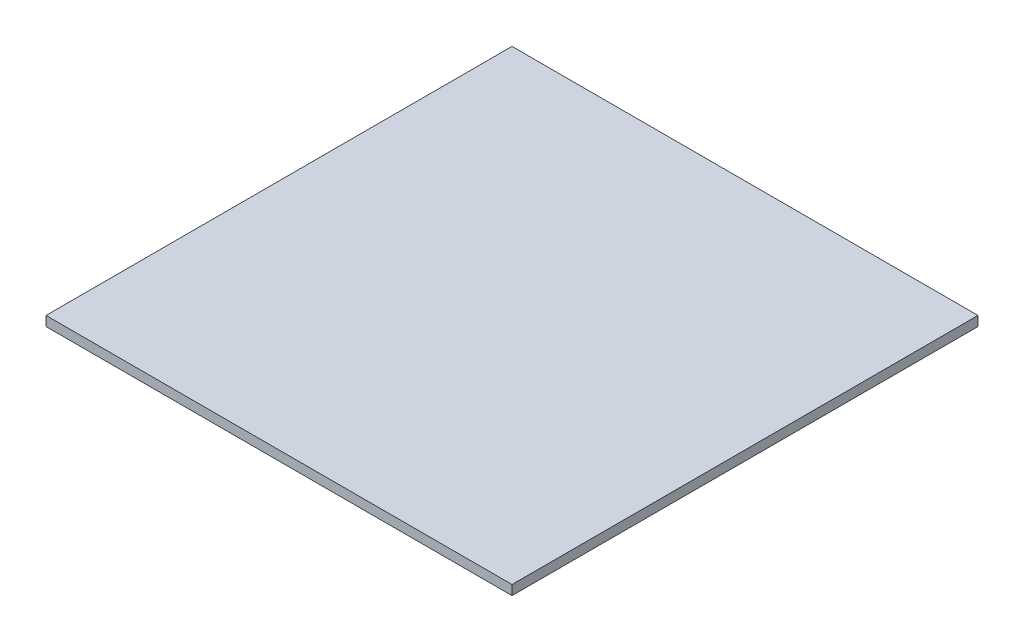
ISO-10303-21;
HEADER;
FILE_DESCRIPTION(('STEP AP214'),'2;1');
FILE_NAME('part.step','',(''),(''),'','','');
FILE_SCHEMA(('AUTOMOTIVE_DESIGN { 1 0 10303 214 1 1 1 1 }'));
ENDSEC;
DATA;
#1=APPLICATION_CONTEXT('core data for automotive mechanical design processes');
#2=APPLICATION_PROTOCOL_DEFINITION('international standard','automotive_design',2000,#1);
#3=PRODUCT_CONTEXT('',#1,'mechanical');
#4=PRODUCT('Part','Part','',(#3));
#5=PRODUCT_RELATED_PRODUCT_CATEGORY('part','',(#4));
#6=PRODUCT_DEFINITION_FORMATION('','',#4);
#7=PRODUCT_DEFINITION_CONTEXT('part definition',#1,'design');
#8=PRODUCT_DEFINITION('design','',#6,#7);
#9=PRODUCT_DEFINITION_SHAPE('','',#8);
#10=(LENGTH_UNIT() NAMED_UNIT(*) SI_UNIT(.MILLI.,.METRE.));
#11=(NAMED_UNIT(*) PLANE_ANGLE_UNIT() SI_UNIT($,.RADIAN.));
#12=(NAMED_UNIT(*) SI_UNIT($,.STERADIAN.) SOLID_ANGLE_UNIT());
#13=UNCERTAINTY_MEASURE_WITH_UNIT(LENGTH_MEASURE(1.E-05),#10,'distance_accuracy_value','');
#14=(GEOMETRIC_REPRESENTATION_CONTEXT(3) GLOBAL_UNCERTAINTY_ASSIGNED_CONTEXT((#13)) GLOBAL_UNIT_ASSIGNED_CONTEXT((#10,
#11,#12)) REPRESENTATION_CONTEXT('',''));
#15=CARTESIAN_POINT('',(0.,0.,0.));
#16=DIRECTION('',(0.,0.,1.));
#17=DIRECTION('',(1.,0.,0.));
#18=AXIS2_PLACEMENT_3D('',#15,#16,#17);
#19=CARTESIAN_POINT('',(0.,36.,0.));
#20=DIRECTION('',(0.,-1.,0.));
#21=DIRECTION('',(0.,0.,-1.));
#22=AXIS2_PLACEMENT_3D('',#19,#20,#21);
#23=CYLINDRICAL_SURFACE('',#22,59.9999999999996);
#24=CARTESIAN_POINT('',(0.,36.,0.));
#25=DIRECTION('',(0.,1.,0.));
#26=DIRECTION('',(0.,0.,1.));
#27=AXIS2_PLACEMENT_3D('',#24,#25,#26);
#28=CIRCLE('',#27,59.9999999999996);
#29=CARTESIAN_POINT('',(0.,36.,59.9999999999996));
#30=VERTEX_POINT('',#29);
#31=EDGE_CURVE('E11',#30,#30,#28,.T.);
#32=ORIENTED_EDGE('',*,*,#31,.F.);
#33=EDGE_LOOP('',(#32));
#34=FACE_BOUND('',#33,.T.);
#35=CARTESIAN_POINT('',(0.,0.,0.));
#36=DIRECTION('',(0.,1.,0.));
#37=DIRECTION('',(0.,0.,1.));
#38=AXIS2_PLACEMENT_3D('',#35,#36,#37);
#39=CIRCLE('',#38,59.9999999999996);
#40=CARTESIAN_POINT('',(0.,0.,59.9999999999996));
#41=VERTEX_POINT('',#40);
#42=EDGE_CURVE('E39',#41,#41,#39,.T.);
#43=ORIENTED_EDGE('',*,*,#42,.T.);
#44=EDGE_LOOP('',(#43));
#45=FACE_BOUND('',#44,.T.);
#46=ADVANCED_FACE('F36',(#34,#45),#23,.T.);
#47=CARTESIAN_POINT('',(0.,0.,0.));
#48=DIRECTION('',(0.,1.,0.));
#49=DIRECTION('',(0.,0.,1.));
#50=AXIS2_PLACEMENT_3D('',#47,#48,#49);
#51=PLANE('',#50);
#52=ORIENTED_EDGE('',*,*,#42,.F.);
#53=EDGE_LOOP('',(#52));
#54=FACE_BOUND('',#53,.T.);
#55=ADVANCED_FACE('F115',(#54),#51,.F.);
#56=CARTESIAN_POINT('',(-145.,42.,-145.));
#57=DIRECTION('',(1.,0.,0.));
#58=DIRECTION('',(0.,0.,-1.));
#59=AXIS2_PLACEMENT_3D('',#56,#57,#58);
#60=PLANE('',#59);
#61=DIRECTION('',(0.,0.,1.));
#62=VECTOR('',#61,1.);
#63=CARTESIAN_POINT('',(-145.,36.,-145.));
#64=LINE('',#63,#62);
#65=CARTESIAN_POINT('',(-145.,36.,-145.));
#66=VERTEX_POINT('',#65);
#67=CARTESIAN_POINT('',(-145.,36.,145.));
#68=VERTEX_POINT('',#67);
#69=EDGE_CURVE('E103',#66,#68,#64,.T.);
#70=ORIENTED_EDGE('',*,*,#69,.T.);
#71=DIRECTION('',(0.,-1.,0.));
#72=VECTOR('',#71,1.);
#73=CARTESIAN_POINT('',(-145.,42.,145.));
#74=LINE('',#73,#72);
#75=CARTESIAN_POINT('',(-145.,42.,145.));
#76=VERTEX_POINT('',#75);
#77=EDGE_CURVE('E94',#76,#68,#74,.T.);
#78=ORIENTED_EDGE('',*,*,#77,.F.);
#79=DIRECTION('',(0.,0.,1.));
#80=VECTOR('',#79,1.);
#81=CARTESIAN_POINT('',(-145.,42.,-145.));
#82=LINE('',#81,#80);
#83=CARTESIAN_POINT('',(-145.,42.,-145.));
#84=VERTEX_POINT('',#83);
#85=EDGE_CURVE('E88',#84,#76,#82,.T.);
#86=ORIENTED_EDGE('',*,*,#85,.F.);
#87=DIRECTION('',(0.,-1.,0.));
#88=VECTOR('',#87,1.);
#89=CARTESIAN_POINT('',(-145.,42.,-145.));
#90=LINE('',#89,#88);
#91=EDGE_CURVE('E99',#84,#66,#90,.T.);
#92=ORIENTED_EDGE('',*,*,#91,.T.);
#93=EDGE_LOOP('',(#70,#78,#86,#92));
#94=FACE_BOUND('',#93,.T.);
#95=ADVANCED_FACE('F117',(#94),#60,.F.);
#96=CARTESIAN_POINT('',(-145.,42.,145.));
#97=DIRECTION('',(0.,0.,-1.));
#98=DIRECTION('',(-1.,0.,0.));
#99=AXIS2_PLACEMENT_3D('',#96,#97,#98);
#100=PLANE('',#99);
#101=DIRECTION('',(1.,0.,0.));
#102=VECTOR('',#101,1.);
#103=CARTESIAN_POINT('',(-145.,36.,145.));
#104=LINE('',#103,#102);
#105=CARTESIAN_POINT('',(145.,36.,145.));
#106=VERTEX_POINT('',#105);
#107=EDGE_CURVE('E93',#68,#106,#104,.T.);
#108=ORIENTED_EDGE('',*,*,#107,.T.);
#109=DIRECTION('',(0.,-1.,0.));
#110=VECTOR('',#109,1.);
#111=CARTESIAN_POINT('',(145.,42.,145.));
#112=LINE('',#111,#110);
#113=CARTESIAN_POINT('',(145.,42.,145.));
#114=VERTEX_POINT('',#113);
#115=EDGE_CURVE('E91',#114,#106,#112,.T.);
#116=ORIENTED_EDGE('',*,*,#115,.F.);
#117=DIRECTION('',(1.,0.,0.));
#118=VECTOR('',#117,1.);
#119=CARTESIAN_POINT('',(-145.,42.,145.));
#120=LINE('',#119,#118);
#121=EDGE_CURVE('E83',#76,#114,#120,.T.);
#122=ORIENTED_EDGE('',*,*,#121,.F.);
#123=ORIENTED_EDGE('',*,*,#77,.T.);
#124=EDGE_LOOP('',(#108,#116,#122,#123));
#125=FACE_BOUND('',#124,.T.);
#126=ADVANCED_FACE('F92',(#125),#100,.F.);
#127=CARTESIAN_POINT('',(145.,42.,-145.));
#128=DIRECTION('',(-1.,0.,0.));
#129=DIRECTION('',(0.,0.,1.));
#130=AXIS2_PLACEMENT_3D('',#127,#128,#129);
#131=PLANE('',#130);
#132=DIRECTION('',(0.,0.,-1.));
#133=VECTOR('',#132,1.);
#134=CARTESIAN_POINT('',(145.,36.,-145.));
#135=LINE('',#134,#133);
#136=CARTESIAN_POINT('',(145.,36.,-145.));
#137=VERTEX_POINT('',#136);
#138=EDGE_CURVE('E69',#106,#137,#135,.T.);
#139=ORIENTED_EDGE('',*,*,#138,.T.);
#140=DIRECTION('',(0.,-1.,0.));
#141=VECTOR('',#140,1.);
#142=CARTESIAN_POINT('',(145.,42.,-145.));
#143=LINE('',#142,#141);
#144=CARTESIAN_POINT('',(145.,42.,-145.));
#145=VERTEX_POINT('',#144);
#146=EDGE_CURVE('E95',#145,#137,#143,.T.);
#147=ORIENTED_EDGE('',*,*,#146,.F.);
#148=DIRECTION('',(0.,0.,-1.));
#149=VECTOR('',#148,1.);
#150=CARTESIAN_POINT('',(145.,42.,-145.));
#151=LINE('',#150,#149);
#152=EDGE_CURVE('E86',#114,#145,#151,.T.);
#153=ORIENTED_EDGE('',*,*,#152,.F.);
#154=ORIENTED_EDGE('',*,*,#115,.T.);
#155=EDGE_LOOP('',(#139,#147,#153,#154));
#156=FACE_BOUND('',#155,.T.);
#157=ADVANCED_FACE('F97',(#156),#131,.F.);
#158=CARTESIAN_POINT('',(-145.,42.,-145.));
#159=DIRECTION('',(0.,0.,1.));
#160=DIRECTION('',(1.,0.,0.));
#161=AXIS2_PLACEMENT_3D('',#158,#159,#160);
#162=PLANE('',#161);
#163=DIRECTION('',(-1.,0.,0.));
#164=VECTOR('',#163,1.);
#165=CARTESIAN_POINT('',(-145.,36.,-145.));
#166=LINE('',#165,#164);
#167=EDGE_CURVE('E75',#137,#66,#166,.T.);
#168=ORIENTED_EDGE('',*,*,#167,.T.);
#169=ORIENTED_EDGE('',*,*,#91,.F.);
#170=DIRECTION('',(-1.,0.,0.));
#171=VECTOR('',#170,1.);
#172=CARTESIAN_POINT('',(-145.,42.,-145.));
#173=LINE('',#172,#171);
#174=EDGE_CURVE('E52',#145,#84,#173,.T.);
#175=ORIENTED_EDGE('',*,*,#174,.F.);
#176=ORIENTED_EDGE('',*,*,#146,.T.);
#177=EDGE_LOOP('',(#168,#169,#175,#176));
#178=FACE_BOUND('',#177,.T.);
#179=ADVANCED_FACE('F130',(#178),#162,.F.);
#180=CARTESIAN_POINT('',(0.,42.,0.));
#181=DIRECTION('',(0.,1.,0.));
#182=DIRECTION('',(0.,0.,1.));
#183=AXIS2_PLACEMENT_3D('',#180,#181,#182);
#184=PLANE('',#183);
#185=ORIENTED_EDGE('',*,*,#85,.T.);
#186=ORIENTED_EDGE('',*,*,#121,.T.);
#187=ORIENTED_EDGE('',*,*,#152,.T.);
#188=ORIENTED_EDGE('',*,*,#174,.T.);
#189=EDGE_LOOP('',(#185,#186,#187,#188));
#190=FACE_BOUND('',#189,.T.);
#191=ADVANCED_FACE('F84',(#190),#184,.T.);
#192=CARTESIAN_POINT('',(0.,36.,0.));
#193=DIRECTION('',(0.,1.,0.));
#194=DIRECTION('',(0.,0.,1.));
#195=AXIS2_PLACEMENT_3D('',#192,#193,#194);
#196=PLANE('',#195);
#197=ORIENTED_EDGE('',*,*,#31,.T.);
#198=EDGE_LOOP('',(#197));
#199=FACE_BOUND('',#198,.T.);
#200=ORIENTED_EDGE('',*,*,#69,.F.);
#201=ORIENTED_EDGE('',*,*,#167,.F.);
#202=ORIENTED_EDGE('',*,*,#138,.F.);
#203=ORIENTED_EDGE('',*,*,#107,.F.);
#204=EDGE_LOOP('',(#200,#201,#202,#203));
#205=FACE_BOUND('',#204,.T.);
#206=ADVANCED_FACE('F133',(#199,#205),#196,.F.);
#207=CLOSED_SHELL('',(#46,#55,#95,#126,#157,#179,#191,#206));
#208=MANIFOLD_SOLID_BREP('B2',#207);
#209=ADVANCED_BREP_SHAPE_REPRESENTATION('',(#18,#208),#14);
#210=SHAPE_DEFINITION_REPRESENTATION(#9,#209);
ENDSEC;
END-ISO-10303-21;
